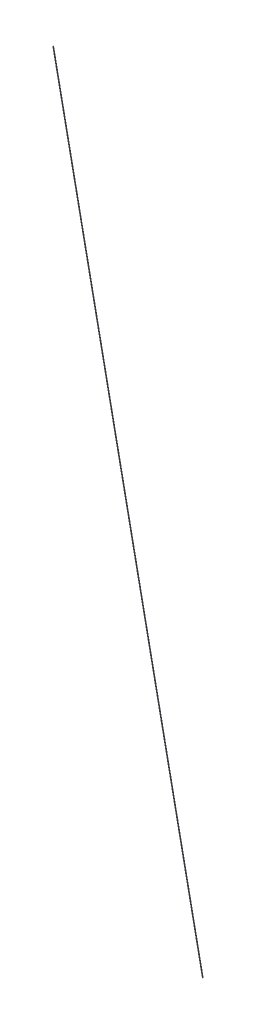
ISO-10303-21;
HEADER;
FILE_DESCRIPTION(('STEP AP214'),'2;1');
FILE_NAME('part.step','',(''),(''),'','','');
FILE_SCHEMA(('AUTOMOTIVE_DESIGN { 1 0 10303 214 1 1 1 1 }'));
ENDSEC;
DATA;
#1=APPLICATION_CONTEXT('core data for automotive mechanical design processes');
#2=APPLICATION_PROTOCOL_DEFINITION('international standard','automotive_design',2000,#1);
#3=PRODUCT_CONTEXT('',#1,'mechanical');
#4=PRODUCT('Part','Part','',(#3));
#5=PRODUCT_RELATED_PRODUCT_CATEGORY('part','',(#4));
#6=PRODUCT_DEFINITION_FORMATION('','',#4);
#7=PRODUCT_DEFINITION_CONTEXT('part definition',#1,'design');
#8=PRODUCT_DEFINITION('design','',#6,#7);
#9=PRODUCT_DEFINITION_SHAPE('','',#8);
#10=(LENGTH_UNIT() NAMED_UNIT(*) SI_UNIT(.MILLI.,.METRE.));
#11=(NAMED_UNIT(*) PLANE_ANGLE_UNIT() SI_UNIT($,.RADIAN.));
#12=(NAMED_UNIT(*) SI_UNIT($,.STERADIAN.) SOLID_ANGLE_UNIT());
#13=UNCERTAINTY_MEASURE_WITH_UNIT(LENGTH_MEASURE(1.E-05),#10,'distance_accuracy_value','');
#14=(GEOMETRIC_REPRESENTATION_CONTEXT(3) GLOBAL_UNCERTAINTY_ASSIGNED_CONTEXT((#13)) GLOBAL_UNIT_ASSIGNED_CONTEXT((#10,
#11,#12)) REPRESENTATION_CONTEXT('',''));
#15=CARTESIAN_POINT('',(0.,0.,0.));
#16=DIRECTION('',(0.,0.,1.));
#17=DIRECTION('',(1.,0.,0.));
#18=AXIS2_PLACEMENT_3D('',#15,#16,#17);
#19=CARTESIAN_POINT('',(307.5,0.,0.));
#20=DIRECTION('',(-0.20018321131915,0.979758481415677,0.));
#21=DIRECTION('',(-0.979758481415677,-0.20018321131915,0.));
#22=AXIS2_PLACEMENT_3D('',#19,#20,#21);
#23=PLANE('',#22);
#24=CARTESIAN_POINT('',(307.5,0.,0.));
#25=DIRECTION('',(-0.20018321131915,0.979758481415677,0.));
#26=DIRECTION('',(-0.979758481415677,-0.20018321131915,0.));
#27=AXIS2_PLACEMENT_3D('',#24,#25,#26);
#28=CIRCLE('',#27,0.499999999999976);
#29=CARTESIAN_POINT('',(307.010120759292,-0.100091605659598,0.));
#30=VERTEX_POINT('',#29);
#31=EDGE_CURVE('E47',#30,#30,#28,.T.);
#32=ORIENTED_EDGE('',*,*,#31,.F.);
#33=EDGE_LOOP('',(#32));
#34=FACE_BOUND('',#33,.T.);
#35=ADVANCED_FACE('F41',(#34),#23,.F.);
#36=CARTESIAN_POINT('',(-1.11022302462516E-13,1505.,0.));
#37=DIRECTION('',(-0.20018321131915,0.979758481415677,0.));
#38=DIRECTION('',(-0.979758481415677,-0.20018321131915,0.));
#39=AXIS2_PLACEMENT_3D('',#36,#37,#38);
#40=PLANE('',#39);
#41=CARTESIAN_POINT('',(-1.11022302462516E-13,1505.,0.));
#42=DIRECTION('',(-0.20018321131915,0.979758481415677,0.));
#43=DIRECTION('',(-0.979758481415677,-0.20018321131915,0.));
#44=AXIS2_PLACEMENT_3D('',#41,#42,#43);
#45=CIRCLE('',#44,0.499999999999976);
#46=CARTESIAN_POINT('',(-0.489879240707925,1504.89990839434,0.));
#47=VERTEX_POINT('',#46);
#48=EDGE_CURVE('E11',#47,#47,#45,.T.);
#49=ORIENTED_EDGE('',*,*,#48,.T.);
#50=EDGE_LOOP('',(#49));
#51=FACE_BOUND('',#50,.T.);
#52=ADVANCED_FACE('F56',(#51),#40,.T.);
#53=CARTESIAN_POINT('',(307.5,0.,0.));
#54=DIRECTION('',(-0.20018321131915,0.979758481415677,0.));
#55=DIRECTION('',(-0.979758481415677,-0.20018321131915,0.));
#56=AXIS2_PLACEMENT_3D('',#53,#54,#55);
#57=CYLINDRICAL_SURFACE('',#56,0.499999999999976);
#58=ORIENTED_EDGE('',*,*,#48,.F.);
#59=EDGE_LOOP('',(#58));
#60=FACE_BOUND('',#59,.T.);
#61=ORIENTED_EDGE('',*,*,#31,.T.);
#62=EDGE_LOOP('',(#61));
#63=FACE_BOUND('',#62,.T.);
#64=ADVANCED_FACE('F53',(#60,#63),#57,.T.);
#65=CLOSED_SHELL('',(#35,#52,#64));
#66=MANIFOLD_SOLID_BREP('B2',#65);
#67=ADVANCED_BREP_SHAPE_REPRESENTATION('',(#18,#66),#14);
#68=SHAPE_DEFINITION_REPRESENTATION(#9,#67);
ENDSEC;
END-ISO-10303-21;
